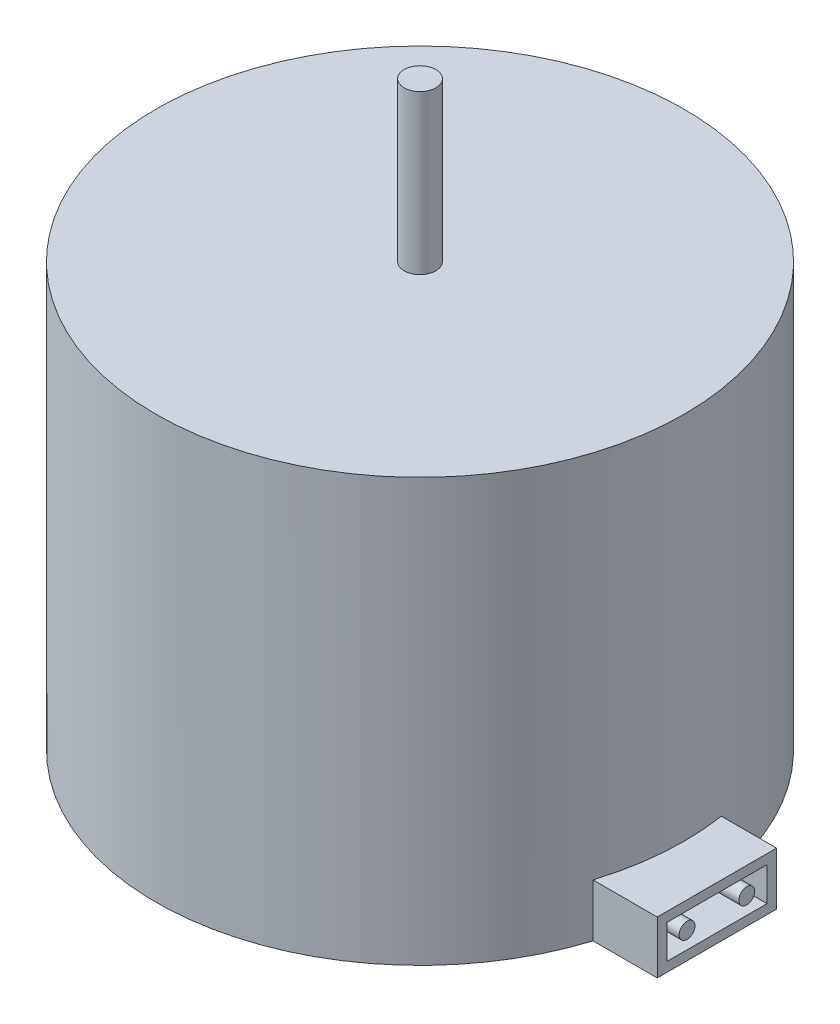
ISO-10303-21;
HEADER;
FILE_DESCRIPTION(('STEP AP214'),'2;1');
FILE_NAME('part.step','',(''),(''),'','','');
FILE_SCHEMA(('AUTOMOTIVE_DESIGN { 1 0 10303 214 1 1 1 1 }'));
ENDSEC;
DATA;
#1=APPLICATION_CONTEXT('core data for automotive mechanical design processes');
#2=APPLICATION_PROTOCOL_DEFINITION('international standard','automotive_design',2000,#1);
#3=PRODUCT_CONTEXT('',#1,'mechanical');
#4=PRODUCT('Part','Part','',(#3));
#5=PRODUCT_RELATED_PRODUCT_CATEGORY('part','',(#4));
#6=PRODUCT_DEFINITION_FORMATION('','',#4);
#7=PRODUCT_DEFINITION_CONTEXT('part definition',#1,'design');
#8=PRODUCT_DEFINITION('design','',#6,#7);
#9=PRODUCT_DEFINITION_SHAPE('','',#8);
#10=(LENGTH_UNIT() NAMED_UNIT(*) SI_UNIT(.MILLI.,.METRE.));
#11=(NAMED_UNIT(*) PLANE_ANGLE_UNIT() SI_UNIT($,.RADIAN.));
#12=(NAMED_UNIT(*) SI_UNIT($,.STERADIAN.) SOLID_ANGLE_UNIT());
#13=UNCERTAINTY_MEASURE_WITH_UNIT(LENGTH_MEASURE(1.E-05),#10,'distance_accuracy_value','');
#14=(GEOMETRIC_REPRESENTATION_CONTEXT(3) GLOBAL_UNCERTAINTY_ASSIGNED_CONTEXT((#13)) GLOBAL_UNIT_ASSIGNED_CONTEXT((#10,
#11,#12)) REPRESENTATION_CONTEXT('',''));
#15=CARTESIAN_POINT('',(0.,0.,0.));
#16=DIRECTION('',(0.,0.,1.));
#17=DIRECTION('',(1.,0.,0.));
#18=AXIS2_PLACEMENT_3D('',#15,#16,#17);
#19=CARTESIAN_POINT('',(29.9326442113793,5.,-3.81229468592367));
#20=DIRECTION('',(1.,0.,0.));
#21=DIRECTION('',(0.,0.,-1.));
#22=AXIS2_PLACEMENT_3D('',#19,#20,#21);
#23=PLANE('',#22);
#24=DIRECTION('',(0.,0.,1.));
#25=VECTOR('',#24,1.);
#26=CARTESIAN_POINT('',(29.9326442113793,0.,-3.81229468592367));
#27=LINE('',#26,#25);
#28=CARTESIAN_POINT('',(29.9326442113793,0.,-3.81229468592367));
#29=VERTEX_POINT('',#28);
#30=CARTESIAN_POINT('',(29.9326442113793,0.,7.48012926712988));
#31=VERTEX_POINT('',#30);
#32=EDGE_CURVE('E184',#29,#31,#27,.T.);
#33=ORIENTED_EDGE('',*,*,#32,.F.);
#34=DIRECTION('',(0.,-1.,0.));
#35=VECTOR('',#34,1.);
#36=CARTESIAN_POINT('',(29.9326442113793,5.,-3.81229468592367));
#37=LINE('',#36,#35);
#38=CARTESIAN_POINT('',(29.9326442113793,5.,-3.81229468592367));
#39=VERTEX_POINT('',#38);
#40=EDGE_CURVE('E212',#39,#29,#37,.T.);
#41=ORIENTED_EDGE('',*,*,#40,.F.);
#42=DIRECTION('',(0.,0.,1.));
#43=VECTOR('',#42,1.);
#44=CARTESIAN_POINT('',(29.9326442113793,5.,-3.81229468592367));
#45=LINE('',#44,#43);
#46=CARTESIAN_POINT('',(29.9326442113793,5.,7.48012926712988));
#47=VERTEX_POINT('',#46);
#48=EDGE_CURVE('E190',#39,#47,#45,.T.);
#49=ORIENTED_EDGE('',*,*,#48,.T.);
#50=DIRECTION('',(0.,-1.,0.));
#51=VECTOR('',#50,1.);
#52=CARTESIAN_POINT('',(29.9326442113793,5.,7.48012926712988));
#53=LINE('',#52,#51);
#54=EDGE_CURVE('E202',#47,#31,#53,.T.);
#55=ORIENTED_EDGE('',*,*,#54,.T.);
#56=EDGE_LOOP('',(#33,#41,#49,#55));
#57=FACE_BOUND('',#56,.T.);
#58=DIRECTION('',(0.,-1.,0.));
#59=VECTOR('',#58,1.);
#60=CARTESIAN_POINT('',(29.9326442113793,4.1,6.58012926712988));
#61=LINE('',#60,#59);
#62=CARTESIAN_POINT('',(29.9326442113793,4.1,6.58012926712988));
#63=VERTEX_POINT('',#62);
#64=CARTESIAN_POINT('',(29.9326442113793,0.9,6.58012926712988));
#65=VERTEX_POINT('',#64);
#66=EDGE_CURVE('E85',#63,#65,#61,.T.);
#67=ORIENTED_EDGE('',*,*,#66,.F.);
#68=DIRECTION('',(0.,0.,1.));
#69=VECTOR('',#68,1.);
#70=CARTESIAN_POINT('',(29.9326442113793,4.1,-2.91229468592367));
#71=LINE('',#70,#69);
#72=CARTESIAN_POINT('',(29.9326442113793,4.1,-2.91229468592367));
#73=VERTEX_POINT('',#72);
#74=EDGE_CURVE('E158',#73,#63,#71,.T.);
#75=ORIENTED_EDGE('',*,*,#74,.F.);
#76=DIRECTION('',(0.,1.,0.));
#77=VECTOR('',#76,1.);
#78=CARTESIAN_POINT('',(29.9326442113793,0.9,-2.91229468592367));
#79=LINE('',#78,#77);
#80=CARTESIAN_POINT('',(29.9326442113793,0.9,-2.91229468592367));
#81=VERTEX_POINT('',#80);
#82=EDGE_CURVE('E162',#81,#73,#79,.T.);
#83=ORIENTED_EDGE('',*,*,#82,.F.);
#84=DIRECTION('',(0.,0.,-1.));
#85=VECTOR('',#84,1.);
#86=CARTESIAN_POINT('',(29.9326442113793,0.9,6.58012926712988));
#87=LINE('',#86,#85);
#88=EDGE_CURVE('E174',#65,#81,#87,.T.);
#89=ORIENTED_EDGE('',*,*,#88,.F.);
#90=EDGE_LOOP('',(#67,#75,#83,#89));
#91=FACE_BOUND('',#90,.T.);
#92=ADVANCED_FACE('F69',(#57,#91),#23,.T.);
#93=CARTESIAN_POINT('',(0.,40.,0.));
#94=DIRECTION('',(0.,-1.,0.));
#95=DIRECTION('',(0.,0.,-1.));
#96=AXIS2_PLACEMENT_3D('',#93,#94,#95);
#97=CYLINDRICAL_SURFACE('',#96,25.);
#98=CARTESIAN_POINT('',(0.,40.,0.));
#99=DIRECTION('',(0.,1.,0.));
#100=DIRECTION('',(0.,0.,1.));
#101=AXIS2_PLACEMENT_3D('',#98,#99,#100);
#102=CIRCLE('',#101,25.);
#103=CARTESIAN_POINT('',(0.,40.,25.));
#104=VERTEX_POINT('',#103);
#105=EDGE_CURVE('E78',#104,#104,#102,.T.);
#106=ORIENTED_EDGE('',*,*,#105,.F.);
#107=EDGE_LOOP('',(#106));
#108=FACE_BOUND('',#107,.T.);
#109=CARTESIAN_POINT('',(0.,5.,0.));
#110=DIRECTION('',(0.,1.,0.));
#111=DIRECTION('',(0.,0.,1.));
#112=AXIS2_PLACEMENT_3D('',#109,#110,#111);
#113=CIRCLE('',#112,25.);
#114=CARTESIAN_POINT('',(23.8547199972464,5.,7.48012926712988));
#115=VERTEX_POINT('',#114);
#116=CARTESIAN_POINT('',(24.7076184450804,5.,-3.81229468592367));
#117=VERTEX_POINT('',#116);
#118=EDGE_CURVE('E12',#115,#117,#113,.T.);
#119=ORIENTED_EDGE('',*,*,#118,.T.);
#120=DIRECTION('',(0.,-1.,0.));
#121=VECTOR('',#120,1.);
#122=CARTESIAN_POINT('',(24.7076184450804,40.,-3.81229468592367));
#123=LINE('',#122,#121);
#124=CARTESIAN_POINT('',(24.7076184450804,0.,-3.81229468592367));
#125=VERTEX_POINT('',#124);
#126=EDGE_CURVE('E221',#117,#125,#123,.T.);
#127=ORIENTED_EDGE('',*,*,#126,.T.);
#128=CARTESIAN_POINT('',(0.,0.,0.));
#129=DIRECTION('',(0.,1.,0.));
#130=DIRECTION('',(0.,0.,1.));
#131=AXIS2_PLACEMENT_3D('',#128,#129,#130);
#132=CIRCLE('',#131,25.);
#133=CARTESIAN_POINT('',(23.8547199972464,0.,7.48012926712988));
#134=VERTEX_POINT('',#133);
#135=EDGE_CURVE('E229',#125,#134,#132,.T.);
#136=ORIENTED_EDGE('',*,*,#135,.T.);
#137=DIRECTION('',(0.,-1.,0.));
#138=VECTOR('',#137,1.);
#139=CARTESIAN_POINT('',(23.8547199972464,40.,7.48012926712988));
#140=LINE('',#139,#138);
#141=EDGE_CURVE('E216',#134,#115,#140,.F.);
#142=ORIENTED_EDGE('',*,*,#141,.T.);
#143=EDGE_LOOP('',(#119,#127,#136,#142));
#144=FACE_BOUND('',#143,.T.);
#145=ADVANCED_FACE('F71',(#108,#144),#97,.T.);
#146=CARTESIAN_POINT('',(0.,40.,0.));
#147=DIRECTION('',(0.,1.,0.));
#148=DIRECTION('',(0.,0.,1.));
#149=AXIS2_PLACEMENT_3D('',#146,#147,#148);
#150=PLANE('',#149);
#151=CARTESIAN_POINT('',(0.,40.,0.));
#152=DIRECTION('',(0.,1.,0.));
#153=DIRECTION('',(0.,0.,1.));
#154=AXIS2_PLACEMENT_3D('',#151,#152,#153);
#155=CIRCLE('',#154,1.5);
#156=CARTESIAN_POINT('',(0.,40.,1.5));
#157=VERTEX_POINT('',#156);
#158=EDGE_CURVE('E224',#157,#157,#155,.T.);
#159=ORIENTED_EDGE('',*,*,#158,.F.);
#160=EDGE_LOOP('',(#159));
#161=FACE_BOUND('',#160,.T.);
#162=ORIENTED_EDGE('',*,*,#105,.T.);
#163=EDGE_LOOP('',(#162));
#164=FACE_BOUND('',#163,.T.);
#165=ADVANCED_FACE('F273',(#161,#164),#150,.T.);
#166=CARTESIAN_POINT('',(0.,0.,0.));
#167=DIRECTION('',(0.,1.,0.));
#168=DIRECTION('',(0.,0.,1.));
#169=AXIS2_PLACEMENT_3D('',#166,#167,#168);
#170=PLANE('',#169);
#171=ORIENTED_EDGE('',*,*,#135,.F.);
#172=DIRECTION('',(1.,0.,0.));
#173=VECTOR('',#172,1.);
#174=CARTESIAN_POINT('',(19.9326442113793,0.,-3.81229468592367));
#175=LINE('',#174,#173);
#176=EDGE_CURVE('E195',#125,#29,#175,.T.);
#177=ORIENTED_EDGE('',*,*,#176,.T.);
#178=ORIENTED_EDGE('',*,*,#32,.T.);
#179=DIRECTION('',(-1.,0.,0.));
#180=VECTOR('',#179,1.);
#181=CARTESIAN_POINT('',(19.9326442113793,0.,7.48012926712988));
#182=LINE('',#181,#180);
#183=EDGE_CURVE('E206',#31,#134,#182,.T.);
#184=ORIENTED_EDGE('',*,*,#183,.T.);
#185=EDGE_LOOP('',(#171,#177,#178,#184));
#186=FACE_BOUND('',#185,.T.);
#187=ADVANCED_FACE('F243',(#186),#170,.F.);
#188=CARTESIAN_POINT('',(0.,55.,0.));
#189=DIRECTION('',(0.,-1.,0.));
#190=DIRECTION('',(0.,0.,-1.));
#191=AXIS2_PLACEMENT_3D('',#188,#189,#190);
#192=CYLINDRICAL_SURFACE('',#191,1.5);
#193=CARTESIAN_POINT('',(0.,55.,0.));
#194=DIRECTION('',(0.,1.,0.));
#195=DIRECTION('',(0.,0.,1.));
#196=AXIS2_PLACEMENT_3D('',#193,#194,#195);
#197=CIRCLE('',#196,1.5);
#198=CARTESIAN_POINT('',(0.,55.,1.5));
#199=VERTEX_POINT('',#198);
#200=EDGE_CURVE('E225',#199,#199,#197,.T.);
#201=ORIENTED_EDGE('',*,*,#200,.F.);
#202=EDGE_LOOP('',(#201));
#203=FACE_BOUND('',#202,.T.);
#204=ORIENTED_EDGE('',*,*,#158,.T.);
#205=EDGE_LOOP('',(#204));
#206=FACE_BOUND('',#205,.T.);
#207=ADVANCED_FACE('F262',(#203,#206),#192,.T.);
#208=CARTESIAN_POINT('',(0.,55.,0.));
#209=DIRECTION('',(0.,1.,0.));
#210=DIRECTION('',(0.,0.,1.));
#211=AXIS2_PLACEMENT_3D('',#208,#209,#210);
#212=PLANE('',#211);
#213=ORIENTED_EDGE('',*,*,#200,.T.);
#214=EDGE_LOOP('',(#213));
#215=FACE_BOUND('',#214,.T.);
#216=ADVANCED_FACE('F255',(#215),#212,.T.);
#217=CARTESIAN_POINT('',(19.9326442113793,5.,-3.81229468592367));
#218=DIRECTION('',(0.,0.,-1.));
#219=DIRECTION('',(-1.,0.,0.));
#220=AXIS2_PLACEMENT_3D('',#217,#218,#219);
#221=PLANE('',#220);
#222=ORIENTED_EDGE('',*,*,#126,.F.);
#223=DIRECTION('',(1.,0.,0.));
#224=VECTOR('',#223,1.);
#225=CARTESIAN_POINT('',(19.9326442113793,5.,-3.81229468592367));
#226=LINE('',#225,#224);
#227=EDGE_CURVE('E199',#117,#39,#226,.T.);
#228=ORIENTED_EDGE('',*,*,#227,.T.);
#229=ORIENTED_EDGE('',*,*,#40,.T.);
#230=ORIENTED_EDGE('',*,*,#176,.F.);
#231=EDGE_LOOP('',(#222,#228,#229,#230));
#232=FACE_BOUND('',#231,.T.);
#233=ADVANCED_FACE('F253',(#232),#221,.T.);
#234=CARTESIAN_POINT('',(19.9326442113793,5.,7.48012926712988));
#235=DIRECTION('',(0.,0.,1.));
#236=DIRECTION('',(1.,0.,0.));
#237=AXIS2_PLACEMENT_3D('',#234,#235,#236);
#238=PLANE('',#237);
#239=ORIENTED_EDGE('',*,*,#141,.F.);
#240=ORIENTED_EDGE('',*,*,#183,.F.);
#241=ORIENTED_EDGE('',*,*,#54,.F.);
#242=DIRECTION('',(-1.,0.,0.));
#243=VECTOR('',#242,1.);
#244=CARTESIAN_POINT('',(19.9326442113793,5.,7.48012926712988));
#245=LINE('',#244,#243);
#246=EDGE_CURVE('E194',#47,#115,#245,.T.);
#247=ORIENTED_EDGE('',*,*,#246,.T.);
#248=EDGE_LOOP('',(#239,#240,#241,#247));
#249=FACE_BOUND('',#248,.T.);
#250=ADVANCED_FACE('F241',(#249),#238,.T.);
#251=CARTESIAN_POINT('',(0.,5.,0.));
#252=DIRECTION('',(0.,1.,0.));
#253=DIRECTION('',(0.,0.,1.));
#254=AXIS2_PLACEMENT_3D('',#251,#252,#253);
#255=PLANE('',#254);
#256=ORIENTED_EDGE('',*,*,#118,.F.);
#257=ORIENTED_EDGE('',*,*,#246,.F.);
#258=ORIENTED_EDGE('',*,*,#48,.F.);
#259=ORIENTED_EDGE('',*,*,#227,.F.);
#260=EDGE_LOOP('',(#256,#257,#258,#259));
#261=FACE_BOUND('',#260,.T.);
#262=ADVANCED_FACE('F250',(#261),#255,.T.);
#263=CARTESIAN_POINT('',(25.9326442113793,0.,0.));
#264=DIRECTION('',(1.,0.,0.));
#265=DIRECTION('',(0.,0.,-1.));
#266=AXIS2_PLACEMENT_3D('',#263,#264,#265);
#267=PLANE('',#266);
#268=CARTESIAN_POINT('',(25.9326442113793,2.5,4.65702327886649));
#269=DIRECTION('',(1.,0.,0.));
#270=DIRECTION('',(0.,0.,-1.));
#271=AXIS2_PLACEMENT_3D('',#268,#269,#270);
#272=CIRCLE('',#271,0.749999999999999);
#273=CARTESIAN_POINT('',(25.9326442113793,2.5,3.90702327886649));
#274=VERTEX_POINT('',#273);
#275=EDGE_CURVE('E175',#274,#274,#272,.T.);
#276=ORIENTED_EDGE('',*,*,#275,.F.);
#277=EDGE_LOOP('',(#276));
#278=FACE_BOUND('',#277,.T.);
#279=DIRECTION('',(0.,-1.,0.));
#280=VECTOR('',#279,1.);
#281=CARTESIAN_POINT('',(25.9326442113793,4.1,6.58012926712988));
#282=LINE('',#281,#280);
#283=CARTESIAN_POINT('',(25.9326442113793,4.1,6.58012926712988));
#284=VERTEX_POINT('',#283);
#285=CARTESIAN_POINT('',(25.9326442113793,0.9,6.58012926712988));
#286=VERTEX_POINT('',#285);
#287=EDGE_CURVE('E136',#284,#286,#282,.T.);
#288=ORIENTED_EDGE('',*,*,#287,.T.);
#289=DIRECTION('',(0.,0.,-1.));
#290=VECTOR('',#289,1.);
#291=CARTESIAN_POINT('',(25.9326442113793,0.9,6.58012926712988));
#292=LINE('',#291,#290);
#293=CARTESIAN_POINT('',(25.9326442113793,0.9,-2.91229468592367));
#294=VERTEX_POINT('',#293);
#295=EDGE_CURVE('E146',#286,#294,#292,.T.);
#296=ORIENTED_EDGE('',*,*,#295,.T.);
#297=DIRECTION('',(0.,1.,0.));
#298=VECTOR('',#297,1.);
#299=CARTESIAN_POINT('',(25.9326442113793,0.9,-2.91229468592367));
#300=LINE('',#299,#298);
#301=CARTESIAN_POINT('',(25.9326442113793,4.1,-2.91229468592367));
#302=VERTEX_POINT('',#301);
#303=EDGE_CURVE('E152',#294,#302,#300,.T.);
#304=ORIENTED_EDGE('',*,*,#303,.T.);
#305=DIRECTION('',(0.,0.,1.));
#306=VECTOR('',#305,1.);
#307=CARTESIAN_POINT('',(25.9326442113793,4.1,-2.91229468592367));
#308=LINE('',#307,#306);
#309=EDGE_CURVE('E143',#302,#284,#308,.T.);
#310=ORIENTED_EDGE('',*,*,#309,.T.);
#311=EDGE_LOOP('',(#288,#296,#304,#310));
#312=FACE_BOUND('',#311,.T.);
#313=CARTESIAN_POINT('',(25.9326442113793,2.5,-0.989188697660285));
#314=DIRECTION('',(-1.,0.,0.));
#315=DIRECTION('',(0.,0.,1.));
#316=AXIS2_PLACEMENT_3D('',#313,#314,#315);
#317=CIRCLE('',#316,0.75);
#318=CARTESIAN_POINT('',(25.9326442113793,2.5,-0.239188697660285));
#319=VERTEX_POINT('',#318);
#320=EDGE_CURVE('E290',#319,#319,#317,.T.);
#321=ORIENTED_EDGE('',*,*,#320,.T.);
#322=EDGE_LOOP('',(#321));
#323=FACE_BOUND('',#322,.T.);
#324=ADVANCED_FACE('F154',(#278,#312,#323),#267,.T.);
#325=CARTESIAN_POINT('',(25.9326442113793,4.1,6.58012926712988));
#326=DIRECTION('',(0.,0.,1.));
#327=DIRECTION('',(1.,0.,0.));
#328=AXIS2_PLACEMENT_3D('',#325,#326,#327);
#329=PLANE('',#328);
#330=ORIENTED_EDGE('',*,*,#66,.T.);
#331=DIRECTION('',(1.,0.,0.));
#332=VECTOR('',#331,1.);
#333=CARTESIAN_POINT('',(25.9326442113793,0.9,6.58012926712988));
#334=LINE('',#333,#332);
#335=EDGE_CURVE('E132',#286,#65,#334,.T.);
#336=ORIENTED_EDGE('',*,*,#335,.F.);
#337=ORIENTED_EDGE('',*,*,#287,.F.);
#338=DIRECTION('',(1.,0.,0.));
#339=VECTOR('',#338,1.);
#340=CARTESIAN_POINT('',(25.9326442113793,4.1,6.58012926712988));
#341=LINE('',#340,#339);
#342=EDGE_CURVE('E181',#284,#63,#341,.T.);
#343=ORIENTED_EDGE('',*,*,#342,.T.);
#344=EDGE_LOOP('',(#330,#336,#337,#343));
#345=FACE_BOUND('',#344,.T.);
#346=ADVANCED_FACE('F134',(#345),#329,.F.);
#347=CARTESIAN_POINT('',(25.9326442113793,4.1,-2.91229468592367));
#348=DIRECTION('',(0.,1.,0.));
#349=DIRECTION('',(0.,0.,1.));
#350=AXIS2_PLACEMENT_3D('',#347,#348,#349);
#351=PLANE('',#350);
#352=ORIENTED_EDGE('',*,*,#74,.T.);
#353=ORIENTED_EDGE('',*,*,#342,.F.);
#354=ORIENTED_EDGE('',*,*,#309,.F.);
#355=DIRECTION('',(1.,0.,0.));
#356=VECTOR('',#355,1.);
#357=CARTESIAN_POINT('',(25.9326442113793,4.1,-2.91229468592367));
#358=LINE('',#357,#356);
#359=EDGE_CURVE('E185',#302,#73,#358,.T.);
#360=ORIENTED_EDGE('',*,*,#359,.T.);
#361=EDGE_LOOP('',(#352,#353,#354,#360));
#362=FACE_BOUND('',#361,.T.);
#363=ADVANCED_FACE('F310',(#362),#351,.F.);
#364=CARTESIAN_POINT('',(25.9326442113793,0.9,-2.91229468592367));
#365=DIRECTION('',(0.,0.,-1.));
#366=DIRECTION('',(-1.,0.,0.));
#367=AXIS2_PLACEMENT_3D('',#364,#365,#366);
#368=PLANE('',#367);
#369=ORIENTED_EDGE('',*,*,#82,.T.);
#370=ORIENTED_EDGE('',*,*,#359,.F.);
#371=ORIENTED_EDGE('',*,*,#303,.F.);
#372=DIRECTION('',(1.,0.,0.));
#373=VECTOR('',#372,1.);
#374=CARTESIAN_POINT('',(25.9326442113793,0.9,-2.91229468592367));
#375=LINE('',#374,#373);
#376=EDGE_CURVE('E142',#294,#81,#375,.T.);
#377=ORIENTED_EDGE('',*,*,#376,.T.);
#378=EDGE_LOOP('',(#369,#370,#371,#377));
#379=FACE_BOUND('',#378,.T.);
#380=ADVANCED_FACE('F317',(#379),#368,.F.);
#381=CARTESIAN_POINT('',(25.9326442113793,0.9,6.58012926712988));
#382=DIRECTION('',(0.,-1.,0.));
#383=DIRECTION('',(0.,0.,-1.));
#384=AXIS2_PLACEMENT_3D('',#381,#382,#383);
#385=PLANE('',#384);
#386=ORIENTED_EDGE('',*,*,#88,.T.);
#387=ORIENTED_EDGE('',*,*,#376,.F.);
#388=ORIENTED_EDGE('',*,*,#295,.F.);
#389=ORIENTED_EDGE('',*,*,#335,.T.);
#390=EDGE_LOOP('',(#386,#387,#388,#389));
#391=FACE_BOUND('',#390,.T.);
#392=ADVANCED_FACE('F147',(#391),#385,.F.);
#393=CARTESIAN_POINT('',(25.9326442113793,2.5,4.65702327886649));
#394=DIRECTION('',(1.,0.,0.));
#395=DIRECTION('',(0.,0.,-1.));
#396=AXIS2_PLACEMENT_3D('',#393,#394,#395);
#397=CYLINDRICAL_SURFACE('',#396,0.749999999999999);
#398=ORIENTED_EDGE('',*,*,#275,.T.);
#399=EDGE_LOOP('',(#398));
#400=FACE_BOUND('',#399,.T.);
#401=CARTESIAN_POINT('',(29.9326442113793,2.5,4.65702327886649));
#402=DIRECTION('',(1.,0.,0.));
#403=DIRECTION('',(0.,0.,-1.));
#404=AXIS2_PLACEMENT_3D('',#401,#402,#403);
#405=CIRCLE('',#404,0.749999999999999);
#406=CARTESIAN_POINT('',(29.9326442113793,2.5,3.90702327886649));
#407=VERTEX_POINT('',#406);
#408=EDGE_CURVE('E165',#407,#407,#405,.T.);
#409=ORIENTED_EDGE('',*,*,#408,.F.);
#410=EDGE_LOOP('',(#409));
#411=FACE_BOUND('',#410,.T.);
#412=ADVANCED_FACE('F283',(#400,#411),#397,.T.);
#413=CARTESIAN_POINT('',(25.9326442113793,2.5,-0.989188697660285));
#414=DIRECTION('',(1.,0.,0.));
#415=DIRECTION('',(0.,0.,-1.));
#416=AXIS2_PLACEMENT_3D('',#413,#414,#415);
#417=CYLINDRICAL_SURFACE('',#416,0.75);
#418=ORIENTED_EDGE('',*,*,#320,.F.);
#419=EDGE_LOOP('',(#418));
#420=FACE_BOUND('',#419,.T.);
#421=CARTESIAN_POINT('',(29.9326442113793,2.5,-0.989188697660285));
#422=DIRECTION('',(-1.,0.,0.));
#423=DIRECTION('',(0.,0.,1.));
#424=AXIS2_PLACEMENT_3D('',#421,#422,#423);
#425=CIRCLE('',#424,0.75);
#426=CARTESIAN_POINT('',(29.9326442113793,2.5,-0.239188697660285));
#427=VERTEX_POINT('',#426);
#428=EDGE_CURVE('E295',#427,#427,#425,.T.);
#429=ORIENTED_EDGE('',*,*,#428,.T.);
#430=EDGE_LOOP('',(#429));
#431=FACE_BOUND('',#430,.T.);
#432=ADVANCED_FACE('F278',(#420,#431),#417,.T.);
#433=ORIENTED_EDGE('',*,*,#408,.T.);
#434=EDGE_LOOP('',(#433));
#435=FACE_BOUND('',#434,.T.);
#436=ADVANCED_FACE('F269',(#435),#23,.T.);
#437=ORIENTED_EDGE('',*,*,#428,.F.);
#438=EDGE_LOOP('',(#437));
#439=FACE_BOUND('',#438,.T.);
#440=ADVANCED_FACE('F268',(#439),#23,.T.);
#441=CLOSED_SHELL('',(#92,#145,#165,#187,#207,#216,#233,#250,#262,#324,#346,#363,#380,#392,#412,
#432,#436,#440));
#442=MANIFOLD_SOLID_BREP('B2',#441);
#443=ADVANCED_BREP_SHAPE_REPRESENTATION('',(#18,#442),#14);
#444=SHAPE_DEFINITION_REPRESENTATION(#9,#443);
ENDSEC;
END-ISO-10303-21;
